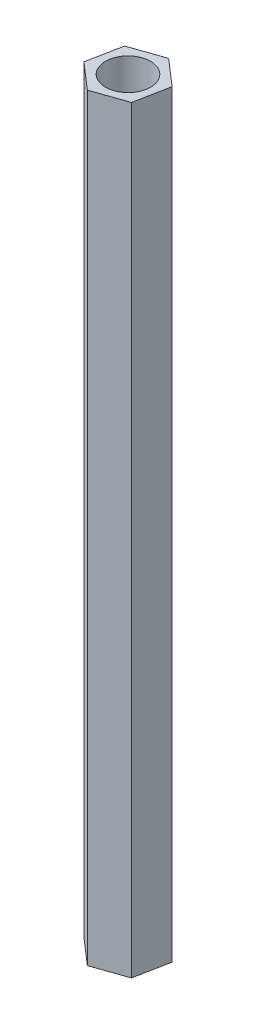
ISO-10303-21;
HEADER;
FILE_DESCRIPTION(('STEP AP214'),'2;1');
FILE_NAME('part.step','',(''),(''),'','','');
FILE_SCHEMA(('AUTOMOTIVE_DESIGN { 1 0 10303 214 1 1 1 1 }'));
ENDSEC;
DATA;
#1=APPLICATION_CONTEXT('core data for automotive mechanical design processes');
#2=APPLICATION_PROTOCOL_DEFINITION('international standard','automotive_design',2000,#1);
#3=PRODUCT_CONTEXT('',#1,'mechanical');
#4=PRODUCT('Part','Part','',(#3));
#5=PRODUCT_RELATED_PRODUCT_CATEGORY('part','',(#4));
#6=PRODUCT_DEFINITION_FORMATION('','',#4);
#7=PRODUCT_DEFINITION_CONTEXT('part definition',#1,'design');
#8=PRODUCT_DEFINITION('design','',#6,#7);
#9=PRODUCT_DEFINITION_SHAPE('','',#8);
#10=(LENGTH_UNIT() NAMED_UNIT(*) SI_UNIT(.MILLI.,.METRE.));
#11=(NAMED_UNIT(*) PLANE_ANGLE_UNIT() SI_UNIT($,.RADIAN.));
#12=(NAMED_UNIT(*) SI_UNIT($,.STERADIAN.) SOLID_ANGLE_UNIT());
#13=UNCERTAINTY_MEASURE_WITH_UNIT(LENGTH_MEASURE(1.E-05),#10,'distance_accuracy_value','');
#14=(GEOMETRIC_REPRESENTATION_CONTEXT(3) GLOBAL_UNCERTAINTY_ASSIGNED_CONTEXT((#13)) GLOBAL_UNIT_ASSIGNED_CONTEXT((#10,
#11,#12)) REPRESENTATION_CONTEXT('',''));
#15=CARTESIAN_POINT('',(0.,0.,0.));
#16=DIRECTION('',(0.,0.,1.));
#17=DIRECTION('',(1.,0.,0.));
#18=AXIS2_PLACEMENT_3D('',#15,#16,#17);
#19=CARTESIAN_POINT('',(-0.43766243311391,50.5,2.26755042457143));
#20=DIRECTION('',(-0.326815655592548,0.,-0.945088105553981));
#21=DIRECTION('',(-0.945088105553981,0.,0.326815655592548));
#22=AXIS2_PLACEMENT_3D('',#19,#20,#21);
#23=PLANE('',#22);
#24=DIRECTION('',(0.945088105553981,0.,-0.326815655592548));
#25=VECTOR('',#24,1.);
#26=CARTESIAN_POINT('',(-0.43766243311391,0.,2.26755042457143));
#27=LINE('',#26,#25);
#28=CARTESIAN_POINT('',(-0.43766243311391,0.,2.26755042457143));
#29=VERTEX_POINT('',#28);
#30=CARTESIAN_POINT('',(1.74492505548409,0.,1.51280199764447));
#31=VERTEX_POINT('',#30);
#32=EDGE_CURVE('E132',#29,#31,#27,.T.);
#33=ORIENTED_EDGE('',*,*,#32,.T.);
#34=DIRECTION('',(0.,-1.,0.));
#35=VECTOR('',#34,1.);
#36=CARTESIAN_POINT('',(1.74492505548409,50.5,1.51280199764447));
#37=LINE('',#36,#35);
#38=CARTESIAN_POINT('',(1.74492505548409,50.5,1.51280199764447));
#39=VERTEX_POINT('',#38);
#40=EDGE_CURVE('E11',#39,#31,#37,.T.);
#41=ORIENTED_EDGE('',*,*,#40,.F.);
#42=DIRECTION('',(0.945088105553981,0.,-0.326815655592548));
#43=VECTOR('',#42,1.);
#44=CARTESIAN_POINT('',(-0.43766243311391,50.5,2.26755042457143));
#45=LINE('',#44,#43);
#46=CARTESIAN_POINT('',(-0.43766243311391,50.5,2.26755042457143));
#47=VERTEX_POINT('',#46);
#48=EDGE_CURVE('E149',#47,#39,#45,.T.);
#49=ORIENTED_EDGE('',*,*,#48,.F.);
#50=DIRECTION('',(0.,-1.,0.));
#51=VECTOR('',#50,1.);
#52=CARTESIAN_POINT('',(-0.43766243311391,50.5,2.26755042457143));
#53=LINE('',#52,#51);
#54=EDGE_CURVE('E128',#47,#29,#53,.T.);
#55=ORIENTED_EDGE('',*,*,#54,.T.);
#56=EDGE_LOOP('',(#33,#41,#49,#55));
#57=FACE_BOUND('',#56,.T.);
#58=ADVANCED_FACE('F43',(#57),#23,.F.);
#59=CARTESIAN_POINT('',(1.74492505548409,50.5,1.51280199764447));
#60=DIRECTION('',(-0.981878136020531,0.,-0.189513392679378));
#61=DIRECTION('',(-0.189513392679378,0.,0.981878136020531));
#62=AXIS2_PLACEMENT_3D('',#59,#60,#61);
#63=PLANE('',#62);
#64=DIRECTION('',(0.189513392679378,0.,-0.981878136020531));
#65=VECTOR('',#64,1.);
#66=CARTESIAN_POINT('',(1.74492505548409,0.,1.51280199764447));
#67=LINE('',#66,#65);
#68=CARTESIAN_POINT('',(2.182587488598,0.,-0.754748426926962));
#69=VERTEX_POINT('',#68);
#70=EDGE_CURVE('E136',#31,#69,#67,.T.);
#71=ORIENTED_EDGE('',*,*,#70,.T.);
#72=DIRECTION('',(0.,-1.,0.));
#73=VECTOR('',#72,1.);
#74=CARTESIAN_POINT('',(2.182587488598,50.5,-0.754748426926962));
#75=LINE('',#74,#73);
#76=CARTESIAN_POINT('',(2.182587488598,50.5,-0.754748426926962));
#77=VERTEX_POINT('',#76);
#78=EDGE_CURVE('E52',#77,#69,#75,.T.);
#79=ORIENTED_EDGE('',*,*,#78,.F.);
#80=DIRECTION('',(0.189513392679378,0.,-0.981878136020531));
#81=VECTOR('',#80,1.);
#82=CARTESIAN_POINT('',(1.74492505548409,50.5,1.51280199764447));
#83=LINE('',#82,#81);
#84=EDGE_CURVE('E97',#39,#77,#83,.T.);
#85=ORIENTED_EDGE('',*,*,#84,.F.);
#86=ORIENTED_EDGE('',*,*,#40,.T.);
#87=EDGE_LOOP('',(#71,#79,#85,#86));
#88=FACE_BOUND('',#87,.T.);
#89=ADVANCED_FACE('F178',(#88),#63,.F.);
#90=CARTESIAN_POINT('',(2.182587488598,50.5,-0.754748426926962));
#91=DIRECTION('',(-0.655062480427982,0.,0.755574712874603));
#92=DIRECTION('',(0.755574712874603,0.,0.655062480427982));
#93=AXIS2_PLACEMENT_3D('',#90,#91,#92);
#94=PLANE('',#93);
#95=DIRECTION('',(-0.755574712874603,0.,-0.655062480427982));
#96=VECTOR('',#95,1.);
#97=CARTESIAN_POINT('',(2.182587488598,0.,-0.754748426926962));
#98=LINE('',#97,#96);
#99=CARTESIAN_POINT('',(0.437662433113909,0.,-2.26755042457143));
#100=VERTEX_POINT('',#99);
#101=EDGE_CURVE('E140',#69,#100,#98,.T.);
#102=ORIENTED_EDGE('',*,*,#101,.T.);
#103=DIRECTION('',(0.,-1.,0.));
#104=VECTOR('',#103,1.);
#105=CARTESIAN_POINT('',(0.437662433113909,50.5,-2.26755042457143));
#106=LINE('',#105,#104);
#107=CARTESIAN_POINT('',(0.437662433113909,50.5,-2.26755042457143));
#108=VERTEX_POINT('',#107);
#109=EDGE_CURVE('E121',#108,#100,#106,.T.);
#110=ORIENTED_EDGE('',*,*,#109,.F.);
#111=DIRECTION('',(-0.755574712874603,0.,-0.655062480427982));
#112=VECTOR('',#111,1.);
#113=CARTESIAN_POINT('',(2.182587488598,50.5,-0.754748426926962));
#114=LINE('',#113,#112);
#115=EDGE_CURVE('E110',#77,#108,#114,.T.);
#116=ORIENTED_EDGE('',*,*,#115,.F.);
#117=ORIENTED_EDGE('',*,*,#78,.T.);
#118=EDGE_LOOP('',(#102,#110,#116,#117));
#119=FACE_BOUND('',#118,.T.);
#120=ADVANCED_FACE('F159',(#119),#94,.F.);
#121=CARTESIAN_POINT('',(0.437662433113909,50.5,-2.26755042457143));
#122=DIRECTION('',(0.326815655592548,0.,0.945088105553981));
#123=DIRECTION('',(0.945088105553981,0.,-0.326815655592548));
#124=AXIS2_PLACEMENT_3D('',#121,#122,#123);
#125=PLANE('',#124);
#126=DIRECTION('',(-0.945088105553981,0.,0.326815655592548));
#127=VECTOR('',#126,1.);
#128=CARTESIAN_POINT('',(0.437662433113909,0.,-2.26755042457143));
#129=LINE('',#128,#127);
#130=CARTESIAN_POINT('',(-1.74492505548409,0.,-1.51280199764447));
#131=VERTEX_POINT('',#130);
#132=EDGE_CURVE('E119',#100,#131,#129,.T.);
#133=ORIENTED_EDGE('',*,*,#132,.T.);
#134=DIRECTION('',(0.,-1.,0.));
#135=VECTOR('',#134,1.);
#136=CARTESIAN_POINT('',(-1.74492505548409,50.5,-1.51280199764447));
#137=LINE('',#136,#135);
#138=CARTESIAN_POINT('',(-1.74492505548409,50.5,-1.51280199764447));
#139=VERTEX_POINT('',#138);
#140=EDGE_CURVE('E116',#139,#131,#137,.T.);
#141=ORIENTED_EDGE('',*,*,#140,.F.);
#142=DIRECTION('',(-0.945088105553981,0.,0.326815655592548));
#143=VECTOR('',#142,1.);
#144=CARTESIAN_POINT('',(0.437662433113909,50.5,-2.26755042457143));
#145=LINE('',#144,#143);
#146=EDGE_CURVE('E104',#108,#139,#145,.T.);
#147=ORIENTED_EDGE('',*,*,#146,.F.);
#148=ORIENTED_EDGE('',*,*,#109,.T.);
#149=EDGE_LOOP('',(#133,#141,#147,#148));
#150=FACE_BOUND('',#149,.T.);
#151=ADVANCED_FACE('F117',(#150),#125,.F.);
#152=CARTESIAN_POINT('',(-1.74492505548409,50.5,-1.51280199764447));
#153=DIRECTION('',(0.981878136020531,0.,0.189513392679378));
#154=DIRECTION('',(0.189513392679378,0.,-0.981878136020531));
#155=AXIS2_PLACEMENT_3D('',#152,#153,#154);
#156=PLANE('',#155);
#157=DIRECTION('',(-0.189513392679378,0.,0.981878136020531));
#158=VECTOR('',#157,1.);
#159=CARTESIAN_POINT('',(-1.74492505548409,0.,-1.51280199764447));
#160=LINE('',#159,#158);
#161=CARTESIAN_POINT('',(-2.182587488598,0.,0.754748426926962));
#162=VERTEX_POINT('',#161);
#163=EDGE_CURVE('E83',#131,#162,#160,.T.);
#164=ORIENTED_EDGE('',*,*,#163,.T.);
#165=DIRECTION('',(0.,-1.,0.));
#166=VECTOR('',#165,1.);
#167=CARTESIAN_POINT('',(-2.182587488598,50.5,0.754748426926962));
#168=LINE('',#167,#166);
#169=CARTESIAN_POINT('',(-2.182587488598,50.5,0.754748426926962));
#170=VERTEX_POINT('',#169);
#171=EDGE_CURVE('E122',#170,#162,#168,.T.);
#172=ORIENTED_EDGE('',*,*,#171,.F.);
#173=DIRECTION('',(-0.189513392679378,0.,0.981878136020531));
#174=VECTOR('',#173,1.);
#175=CARTESIAN_POINT('',(-1.74492505548409,50.5,-1.51280199764447));
#176=LINE('',#175,#174);
#177=EDGE_CURVE('E108',#139,#170,#176,.T.);
#178=ORIENTED_EDGE('',*,*,#177,.F.);
#179=ORIENTED_EDGE('',*,*,#140,.T.);
#180=EDGE_LOOP('',(#164,#172,#178,#179));
#181=FACE_BOUND('',#180,.T.);
#182=ADVANCED_FACE('F124',(#181),#156,.F.);
#183=CARTESIAN_POINT('',(-2.182587488598,50.5,0.754748426926962));
#184=DIRECTION('',(0.655062480427983,0.,-0.755574712874603));
#185=DIRECTION('',(-0.755574712874603,0.,-0.655062480427983));
#186=AXIS2_PLACEMENT_3D('',#183,#184,#185);
#187=PLANE('',#186);
#188=DIRECTION('',(0.755574712874603,0.,0.655062480427983));
#189=VECTOR('',#188,1.);
#190=CARTESIAN_POINT('',(-2.182587488598,0.,0.754748426926962));
#191=LINE('',#190,#189);
#192=EDGE_CURVE('E89',#162,#29,#191,.T.);
#193=ORIENTED_EDGE('',*,*,#192,.T.);
#194=ORIENTED_EDGE('',*,*,#54,.F.);
#195=DIRECTION('',(0.755574712874603,0.,0.655062480427983));
#196=VECTOR('',#195,1.);
#197=CARTESIAN_POINT('',(-2.182587488598,50.5,0.754748426926962));
#198=LINE('',#197,#196);
#199=EDGE_CURVE('E60',#170,#47,#198,.T.);
#200=ORIENTED_EDGE('',*,*,#199,.F.);
#201=ORIENTED_EDGE('',*,*,#171,.T.);
#202=EDGE_LOOP('',(#193,#194,#200,#201));
#203=FACE_BOUND('',#202,.T.);
#204=ADVANCED_FACE('F166',(#203),#187,.F.);
#205=CARTESIAN_POINT('',(0.,50.5,0.));
#206=DIRECTION('',(0.,1.,0.));
#207=DIRECTION('',(0.,0.,1.));
#208=AXIS2_PLACEMENT_3D('',#205,#206,#207);
#209=PLANE('',#208);
#210=CARTESIAN_POINT('',(0.,50.5,0.));
#211=DIRECTION('',(0.,1.,0.));
#212=DIRECTION('',(0.,0.,1.));
#213=AXIS2_PLACEMENT_3D('',#210,#211,#212);
#214=CIRCLE('',#213,1.5);
#215=CARTESIAN_POINT('',(0.,50.5,1.5));
#216=VERTEX_POINT('',#215);
#217=EDGE_CURVE('E265',#216,#216,#214,.T.);
#218=ORIENTED_EDGE('',*,*,#217,.F.);
#219=EDGE_LOOP('',(#218));
#220=FACE_BOUND('',#219,.T.);
#221=ORIENTED_EDGE('',*,*,#48,.T.);
#222=ORIENTED_EDGE('',*,*,#84,.T.);
#223=ORIENTED_EDGE('',*,*,#115,.T.);
#224=ORIENTED_EDGE('',*,*,#146,.T.);
#225=ORIENTED_EDGE('',*,*,#177,.T.);
#226=ORIENTED_EDGE('',*,*,#199,.T.);
#227=EDGE_LOOP('',(#221,#222,#223,#224,#225,#226));
#228=FACE_BOUND('',#227,.T.);
#229=ADVANCED_FACE('F106',(#220,#228),#209,.T.);
#230=CARTESIAN_POINT('',(0.,0.,0.));
#231=DIRECTION('',(0.,1.,0.));
#232=DIRECTION('',(0.,0.,1.));
#233=AXIS2_PLACEMENT_3D('',#230,#231,#232);
#234=PLANE('',#233);
#235=CARTESIAN_POINT('',(0.,0.,0.));
#236=DIRECTION('',(0.,1.,0.));
#237=DIRECTION('',(0.,0.,1.));
#238=AXIS2_PLACEMENT_3D('',#235,#236,#237);
#239=CIRCLE('',#238,1.5);
#240=CARTESIAN_POINT('',(0.,0.,1.5));
#241=VERTEX_POINT('',#240);
#242=EDGE_CURVE('E137',#241,#241,#239,.T.);
#243=ORIENTED_EDGE('',*,*,#242,.T.);
#244=EDGE_LOOP('',(#243));
#245=FACE_BOUND('',#244,.T.);
#246=ORIENTED_EDGE('',*,*,#32,.F.);
#247=ORIENTED_EDGE('',*,*,#192,.F.);
#248=ORIENTED_EDGE('',*,*,#163,.F.);
#249=ORIENTED_EDGE('',*,*,#132,.F.);
#250=ORIENTED_EDGE('',*,*,#101,.F.);
#251=ORIENTED_EDGE('',*,*,#70,.F.);
#252=EDGE_LOOP('',(#246,#247,#248,#249,#250,#251));
#253=FACE_BOUND('',#252,.T.);
#254=ADVANCED_FACE('F162',(#245,#253),#234,.F.);
#255=CARTESIAN_POINT('',(0.,0.,0.));
#256=DIRECTION('',(0.,1.,0.));
#257=DIRECTION('',(0.,0.,1.));
#258=AXIS2_PLACEMENT_3D('',#255,#256,#257);
#259=CYLINDRICAL_SURFACE('',#258,1.5);
#260=ORIENTED_EDGE('',*,*,#242,.F.);
#261=EDGE_LOOP('',(#260));
#262=FACE_BOUND('',#261,.T.);
#263=ORIENTED_EDGE('',*,*,#217,.T.);
#264=EDGE_LOOP('',(#263));
#265=FACE_BOUND('',#264,.T.);
#266=ADVANCED_FACE('F218',(#262,#265),#259,.F.);
#267=CLOSED_SHELL('',(#58,#89,#120,#151,#182,#204,#229,#254,#266));
#268=MANIFOLD_SOLID_BREP('B2',#267);
#269=ADVANCED_BREP_SHAPE_REPRESENTATION('',(#18,#268),#14);
#270=SHAPE_DEFINITION_REPRESENTATION(#9,#269);
ENDSEC;
END-ISO-10303-21;
